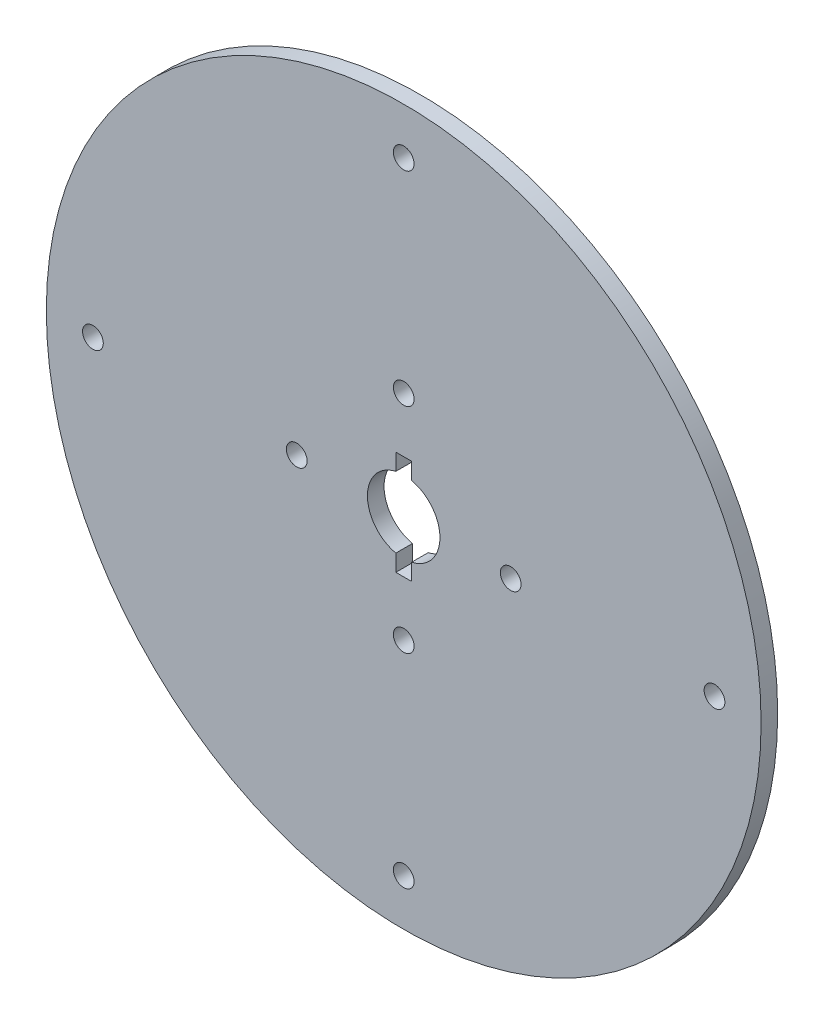
ISO-10303-21;
HEADER;
FILE_DESCRIPTION(('STEP AP214'),'2;1');
FILE_NAME('part.step','',(''),(''),'','','');
FILE_SCHEMA(('AUTOMOTIVE_DESIGN { 1 0 10303 214 1 1 1 1 }'));
ENDSEC;
DATA;
#1=APPLICATION_CONTEXT('core data for automotive mechanical design processes');
#2=APPLICATION_PROTOCOL_DEFINITION('international standard','automotive_design',2000,#1);
#3=PRODUCT_CONTEXT('',#1,'mechanical');
#4=PRODUCT('Part','Part','',(#3));
#5=PRODUCT_RELATED_PRODUCT_CATEGORY('part','',(#4));
#6=PRODUCT_DEFINITION_FORMATION('','',#4);
#7=PRODUCT_DEFINITION_CONTEXT('part definition',#1,'design');
#8=PRODUCT_DEFINITION('design','',#6,#7);
#9=PRODUCT_DEFINITION_SHAPE('','',#8);
#10=(LENGTH_UNIT() NAMED_UNIT(*) SI_UNIT(.MILLI.,.METRE.));
#11=(NAMED_UNIT(*) PLANE_ANGLE_UNIT() SI_UNIT($,.RADIAN.));
#12=(NAMED_UNIT(*) SI_UNIT($,.STERADIAN.) SOLID_ANGLE_UNIT());
#13=UNCERTAINTY_MEASURE_WITH_UNIT(LENGTH_MEASURE(1.E-05),#10,'distance_accuracy_value','');
#14=(GEOMETRIC_REPRESENTATION_CONTEXT(3) GLOBAL_UNCERTAINTY_ASSIGNED_CONTEXT((#13)) GLOBAL_UNIT_ASSIGNED_CONTEXT((#10,
#11,#12)) REPRESENTATION_CONTEXT('',''));
#15=CARTESIAN_POINT('',(0.,0.,0.));
#16=DIRECTION('',(0.,0.,1.));
#17=DIRECTION('',(1.,0.,0.));
#18=AXIS2_PLACEMENT_3D('',#15,#16,#17);
#19=CARTESIAN_POINT('',(0.,0.,3.2));
#20=DIRECTION('',(0.,0.,1.));
#21=DIRECTION('',(1.,0.,0.));
#22=AXIS2_PLACEMENT_3D('',#19,#20,#21);
#23=PLANE('',#22);
#24=CARTESIAN_POINT('',(2.23271950224158E-11,-60.,3.2));
#25=DIRECTION('',(0.,0.,1.));
#26=DIRECTION('',(1.,0.,0.));
#27=AXIS2_PLACEMENT_3D('',#24,#25,#26);
#28=CIRCLE('',#27,2.);
#29=CARTESIAN_POINT('',(2.00000000002233,-60.,3.2));
#30=VERTEX_POINT('',#29);
#31=EDGE_CURVE('E349',#30,#30,#28,.T.);
#32=ORIENTED_EDGE('',*,*,#31,.F.);
#33=EDGE_LOOP('',(#32));
#34=FACE_BOUND('',#33,.T.);
#35=CARTESIAN_POINT('',(-20.6500000000006,-1.03042574473022E-12,3.2));
#36=DIRECTION('',(0.,0.,1.));
#37=DIRECTION('',(1.,0.,0.));
#38=AXIS2_PLACEMENT_3D('',#35,#36,#37);
#39=CIRCLE('',#38,2.);
#40=CARTESIAN_POINT('',(-18.6500000000006,-1.03042574473022E-12,3.2));
#41=VERTEX_POINT('',#40);
#42=EDGE_CURVE('E361',#41,#41,#39,.T.);
#43=ORIENTED_EDGE('',*,*,#42,.F.);
#44=EDGE_LOOP('',(#43));
#45=FACE_BOUND('',#44,.T.);
#46=CARTESIAN_POINT('',(20.6500000000006,-1.02348685082632E-13,3.2));
#47=DIRECTION('',(0.,0.,1.));
#48=DIRECTION('',(1.,0.,0.));
#49=AXIS2_PLACEMENT_3D('',#46,#47,#48);
#50=CIRCLE('',#49,2.);
#51=CARTESIAN_POINT('',(22.6500000000006,-1.02348685082632E-13,3.2));
#52=VERTEX_POINT('',#51);
#53=EDGE_CURVE('E373',#52,#52,#50,.T.);
#54=ORIENTED_EDGE('',*,*,#53,.F.);
#55=EDGE_LOOP('',(#54));
#56=FACE_BOUND('',#55,.T.);
#57=CARTESIAN_POINT('',(0.,20.65,3.2));
#58=DIRECTION('',(0.,0.,1.));
#59=DIRECTION('',(1.,0.,0.));
#60=AXIS2_PLACEMENT_3D('',#57,#58,#59);
#61=CIRCLE('',#60,2.);
#62=CARTESIAN_POINT('',(2.00000000000001,20.65,3.2));
#63=VERTEX_POINT('',#62);
#64=EDGE_CURVE('E134',#63,#63,#61,.T.);
#65=ORIENTED_EDGE('',*,*,#64,.F.);
#66=EDGE_LOOP('',(#65));
#67=FACE_BOUND('',#66,.T.);
#68=CARTESIAN_POINT('',(0.,0.,3.2));
#69=DIRECTION('',(0.,0.,1.));
#70=DIRECTION('',(1.,0.,0.));
#71=AXIS2_PLACEMENT_3D('',#68,#69,#70);
#72=CIRCLE('',#71,69.);
#73=CARTESIAN_POINT('',(69.,0.,3.2));
#74=VERTEX_POINT('',#73);
#75=EDGE_CURVE('E11',#74,#74,#72,.T.);
#76=ORIENTED_EDGE('',*,*,#75,.T.);
#77=EDGE_LOOP('',(#76));
#78=FACE_BOUND('',#77,.T.);
#79=CARTESIAN_POINT('',(1.00028492433513E-12,0.,3.2));
#80=DIRECTION('',(0.,0.,1.));
#81=DIRECTION('',(1.,0.,0.));
#82=AXIS2_PLACEMENT_3D('',#79,#80,#81);
#83=CIRCLE('',#82,7.00000000000022);
#84=CARTESIAN_POINT('',(-1.52499999999999,6.83186467957321,3.2));
#85=VERTEX_POINT('',#84);
#86=CARTESIAN_POINT('',(-1.52499999999999,-6.83186467957321,3.2));
#87=VERTEX_POINT('',#86);
#88=EDGE_CURVE('E105',#85,#87,#83,.T.);
#89=ORIENTED_EDGE('',*,*,#88,.F.);
#90=DIRECTION('',(0.,-1.,0.));
#91=VECTOR('',#90,1.);
#92=CARTESIAN_POINT('',(-1.52499999999999,10.05,3.2));
#93=LINE('',#92,#91);
#94=CARTESIAN_POINT('',(-1.52499999999999,10.05,3.2));
#95=VERTEX_POINT('',#94);
#96=EDGE_CURVE('E97',#95,#85,#93,.T.);
#97=ORIENTED_EDGE('',*,*,#96,.F.);
#98=DIRECTION('',(-1.,0.,0.));
#99=VECTOR('',#98,1.);
#100=CARTESIAN_POINT('',(-1.52499999999999,10.05,3.2));
#101=LINE('',#100,#99);
#102=CARTESIAN_POINT('',(1.52500000000001,10.05,3.2));
#103=VERTEX_POINT('',#102);
#104=EDGE_CURVE('E131',#103,#95,#101,.T.);
#105=ORIENTED_EDGE('',*,*,#104,.F.);
#106=DIRECTION('',(0.,1.,0.));
#107=VECTOR('',#106,1.);
#108=CARTESIAN_POINT('',(1.52500000000001,10.05,3.2));
#109=LINE('',#108,#107);
#110=CARTESIAN_POINT('',(1.52500000000001,6.83186467957321,3.2));
#111=VERTEX_POINT('',#110);
#112=EDGE_CURVE('E129',#111,#103,#109,.T.);
#113=ORIENTED_EDGE('',*,*,#112,.F.);
#114=CARTESIAN_POINT('',(9.79034561754411E-13,0.,3.2));
#115=DIRECTION('',(0.,0.,1.));
#116=DIRECTION('',(-1.,0.,0.));
#117=AXIS2_PLACEMENT_3D('',#114,#115,#116);
#118=CIRCLE('',#117,6.99999999999979);
#119=CARTESIAN_POINT('',(1.52500000000001,-6.83186467957321,3.2));
#120=VERTEX_POINT('',#119);
#121=EDGE_CURVE('E127',#120,#111,#118,.T.);
#122=ORIENTED_EDGE('',*,*,#121,.F.);
#123=DIRECTION('',(0.,1.,0.));
#124=VECTOR('',#123,1.);
#125=CARTESIAN_POINT('',(1.52500000000001,-10.05,3.2));
#126=LINE('',#125,#124);
#127=CARTESIAN_POINT('',(1.52500000000001,-10.05,3.2));
#128=VERTEX_POINT('',#127);
#129=EDGE_CURVE('E125',#128,#120,#126,.T.);
#130=ORIENTED_EDGE('',*,*,#129,.F.);
#131=DIRECTION('',(1.,0.,0.));
#132=VECTOR('',#131,1.);
#133=CARTESIAN_POINT('',(-1.52499999999999,-10.05,3.2));
#134=LINE('',#133,#132);
#135=CARTESIAN_POINT('',(-1.52499999999999,-10.05,3.2));
#136=VERTEX_POINT('',#135);
#137=EDGE_CURVE('E120',#136,#128,#134,.T.);
#138=ORIENTED_EDGE('',*,*,#137,.F.);
#139=DIRECTION('',(0.,-1.,0.));
#140=VECTOR('',#139,1.);
#141=CARTESIAN_POINT('',(-1.52499999999999,-10.05,3.2));
#142=LINE('',#141,#140);
#143=EDGE_CURVE('E118',#87,#136,#142,.T.);
#144=ORIENTED_EDGE('',*,*,#143,.F.);
#145=EDGE_LOOP('',(#89,#97,#105,#113,#122,#130,#138,#144));
#146=FACE_BOUND('',#145,.T.);
#147=CARTESIAN_POINT('',(0.,60.,3.2));
#148=DIRECTION('',(0.,0.,1.));
#149=DIRECTION('',(1.,0.,0.));
#150=AXIS2_PLACEMENT_3D('',#147,#148,#149);
#151=CIRCLE('',#150,2.);
#152=CARTESIAN_POINT('',(1.99999999999999,60.,3.2));
#153=VERTEX_POINT('',#152);
#154=EDGE_CURVE('E379',#153,#153,#151,.T.);
#155=ORIENTED_EDGE('',*,*,#154,.F.);
#156=EDGE_LOOP('',(#155));
#157=FACE_BOUND('',#156,.T.);
#158=CARTESIAN_POINT('',(4.65137769486632E-13,-20.6500000000009,3.2));
#159=DIRECTION('',(0.,0.,1.));
#160=DIRECTION('',(1.,0.,0.));
#161=AXIS2_PLACEMENT_3D('',#158,#159,#160);
#162=CIRCLE('',#161,2.);
#163=CARTESIAN_POINT('',(2.00000000000047,-20.6500000000009,3.2));
#164=VERTEX_POINT('',#163);
#165=EDGE_CURVE('E367',#164,#164,#162,.T.);
#166=ORIENTED_EDGE('',*,*,#165,.F.);
#167=EDGE_LOOP('',(#166));
#168=FACE_BOUND('',#167,.T.);
#169=CARTESIAN_POINT('',(60.0000000000111,1.11693024223492E-11,3.2));
#170=DIRECTION('',(0.,0.,1.));
#171=DIRECTION('',(1.,0.,0.));
#172=AXIS2_PLACEMENT_3D('',#169,#170,#171);
#173=CIRCLE('',#172,2.);
#174=CARTESIAN_POINT('',(62.0000000000111,1.11693024223492E-11,3.2));
#175=VERTEX_POINT('',#174);
#176=EDGE_CURVE('E355',#175,#175,#173,.T.);
#177=ORIENTED_EDGE('',*,*,#176,.F.);
#178=EDGE_LOOP('',(#177));
#179=FACE_BOUND('',#178,.T.);
#180=CARTESIAN_POINT('',(-59.9999999999888,-1.11766503031441E-11,3.2));
#181=DIRECTION('',(0.,0.,1.));
#182=DIRECTION('',(1.,0.,0.));
#183=AXIS2_PLACEMENT_3D('',#180,#181,#182);
#184=CIRCLE('',#183,2.);
#185=CARTESIAN_POINT('',(-57.9999999999888,-1.11766503031441E-11,3.2));
#186=VERTEX_POINT('',#185);
#187=EDGE_CURVE('E340',#186,#186,#184,.T.);
#188=ORIENTED_EDGE('',*,*,#187,.F.);
#189=EDGE_LOOP('',(#188));
#190=FACE_BOUND('',#189,.T.);
#191=ADVANCED_FACE('F32',(#34,#45,#56,#67,#78,#146,#157,#168,#179,#190),#23,.T.);
#192=CARTESIAN_POINT('',(0.,0.,0.));
#193=DIRECTION('',(0.,0.,1.));
#194=DIRECTION('',(1.,0.,0.));
#195=AXIS2_PLACEMENT_3D('',#192,#193,#194);
#196=PLANE('',#195);
#197=CARTESIAN_POINT('',(0.,0.,0.));
#198=DIRECTION('',(0.,0.,1.));
#199=DIRECTION('',(1.,0.,0.));
#200=AXIS2_PLACEMENT_3D('',#197,#198,#199);
#201=CIRCLE('',#200,69.);
#202=CARTESIAN_POINT('',(69.,0.,0.));
#203=VERTEX_POINT('',#202);
#204=EDGE_CURVE('E36',#203,#203,#201,.T.);
#205=ORIENTED_EDGE('',*,*,#204,.F.);
#206=EDGE_LOOP('',(#205));
#207=FACE_BOUND('',#206,.T.);
#208=DIRECTION('',(0.,-1.,0.));
#209=VECTOR('',#208,1.);
#210=CARTESIAN_POINT('',(-1.52499999999999,10.05,0.));
#211=LINE('',#210,#209);
#212=CARTESIAN_POINT('',(-1.52499999999999,10.05,0.));
#213=VERTEX_POINT('',#212);
#214=CARTESIAN_POINT('',(-1.52499999999999,6.83186467957321,0.));
#215=VERTEX_POINT('',#214);
#216=EDGE_CURVE('E55',#213,#215,#211,.T.);
#217=ORIENTED_EDGE('',*,*,#216,.T.);
#218=CARTESIAN_POINT('',(1.00028492433513E-12,0.,0.));
#219=DIRECTION('',(0.,0.,1.));
#220=DIRECTION('',(1.,0.,0.));
#221=AXIS2_PLACEMENT_3D('',#218,#219,#220);
#222=CIRCLE('',#221,7.00000000000022);
#223=CARTESIAN_POINT('',(-1.52499999999999,-6.83186467957321,0.));
#224=VERTEX_POINT('',#223);
#225=EDGE_CURVE('E112',#215,#224,#222,.T.);
#226=ORIENTED_EDGE('',*,*,#225,.T.);
#227=DIRECTION('',(0.,-1.,0.));
#228=VECTOR('',#227,1.);
#229=CARTESIAN_POINT('',(-1.52499999999999,-10.05,0.));
#230=LINE('',#229,#228);
#231=CARTESIAN_POINT('',(-1.52499999999999,-10.05,0.));
#232=VERTEX_POINT('',#231);
#233=EDGE_CURVE('E136',#224,#232,#230,.T.);
#234=ORIENTED_EDGE('',*,*,#233,.T.);
#235=DIRECTION('',(1.,0.,0.));
#236=VECTOR('',#235,1.);
#237=CARTESIAN_POINT('',(-1.52499999999999,-10.05,0.));
#238=LINE('',#237,#236);
#239=CARTESIAN_POINT('',(1.52500000000001,-10.05,0.));
#240=VERTEX_POINT('',#239);
#241=EDGE_CURVE('E139',#232,#240,#238,.T.);
#242=ORIENTED_EDGE('',*,*,#241,.T.);
#243=DIRECTION('',(0.,1.,0.));
#244=VECTOR('',#243,1.);
#245=CARTESIAN_POINT('',(1.52500000000001,-10.05,0.));
#246=LINE('',#245,#244);
#247=CARTESIAN_POINT('',(1.52500000000001,-6.83186467957321,0.));
#248=VERTEX_POINT('',#247);
#249=EDGE_CURVE('E142',#240,#248,#246,.T.);
#250=ORIENTED_EDGE('',*,*,#249,.T.);
#251=CARTESIAN_POINT('',(9.79034561754411E-13,0.,0.));
#252=DIRECTION('',(0.,0.,1.));
#253=DIRECTION('',(-1.,0.,0.));
#254=AXIS2_PLACEMENT_3D('',#251,#252,#253);
#255=CIRCLE('',#254,6.99999999999979);
#256=CARTESIAN_POINT('',(1.52500000000001,6.83186467957321,0.));
#257=VERTEX_POINT('',#256);
#258=EDGE_CURVE('E145',#248,#257,#255,.T.);
#259=ORIENTED_EDGE('',*,*,#258,.T.);
#260=DIRECTION('',(0.,1.,0.));
#261=VECTOR('',#260,1.);
#262=CARTESIAN_POINT('',(1.52500000000001,10.05,0.));
#263=LINE('',#262,#261);
#264=CARTESIAN_POINT('',(1.52500000000001,10.05,0.));
#265=VERTEX_POINT('',#264);
#266=EDGE_CURVE('E148',#257,#265,#263,.T.);
#267=ORIENTED_EDGE('',*,*,#266,.T.);
#268=DIRECTION('',(-1.,0.,0.));
#269=VECTOR('',#268,1.);
#270=CARTESIAN_POINT('',(-1.52499999999999,10.05,0.));
#271=LINE('',#270,#269);
#272=EDGE_CURVE('E106',#265,#213,#271,.T.);
#273=ORIENTED_EDGE('',*,*,#272,.T.);
#274=EDGE_LOOP('',(#217,#226,#234,#242,#250,#259,#267,#273));
#275=FACE_BOUND('',#274,.T.);
#276=CARTESIAN_POINT('',(0.,20.65,0.));
#277=DIRECTION('',(0.,0.,1.));
#278=DIRECTION('',(1.,0.,0.));
#279=AXIS2_PLACEMENT_3D('',#276,#277,#278);
#280=CIRCLE('',#279,2.);
#281=CARTESIAN_POINT('',(2.00000000000001,20.65,0.));
#282=VERTEX_POINT('',#281);
#283=EDGE_CURVE('E382',#282,#282,#280,.T.);
#284=ORIENTED_EDGE('',*,*,#283,.T.);
#285=EDGE_LOOP('',(#284));
#286=FACE_BOUND('',#285,.T.);
#287=CARTESIAN_POINT('',(0.,60.,0.));
#288=DIRECTION('',(0.,0.,1.));
#289=DIRECTION('',(1.,0.,0.));
#290=AXIS2_PLACEMENT_3D('',#287,#288,#289);
#291=CIRCLE('',#290,2.);
#292=CARTESIAN_POINT('',(1.99999999999999,60.,0.));
#293=VERTEX_POINT('',#292);
#294=EDGE_CURVE('E376',#293,#293,#291,.T.);
#295=ORIENTED_EDGE('',*,*,#294,.T.);
#296=EDGE_LOOP('',(#295));
#297=FACE_BOUND('',#296,.T.);
#298=CARTESIAN_POINT('',(20.6500000000006,-1.02348685082632E-13,0.));
#299=DIRECTION('',(0.,0.,1.));
#300=DIRECTION('',(1.,0.,0.));
#301=AXIS2_PLACEMENT_3D('',#298,#299,#300);
#302=CIRCLE('',#301,2.);
#303=CARTESIAN_POINT('',(22.6500000000006,-1.02348685082632E-13,0.));
#304=VERTEX_POINT('',#303);
#305=EDGE_CURVE('E370',#304,#304,#302,.T.);
#306=ORIENTED_EDGE('',*,*,#305,.T.);
#307=EDGE_LOOP('',(#306));
#308=FACE_BOUND('',#307,.T.);
#309=CARTESIAN_POINT('',(4.65137769486632E-13,-20.6500000000009,0.));
#310=DIRECTION('',(0.,0.,1.));
#311=DIRECTION('',(1.,0.,0.));
#312=AXIS2_PLACEMENT_3D('',#309,#310,#311);
#313=CIRCLE('',#312,2.);
#314=CARTESIAN_POINT('',(2.00000000000047,-20.6500000000009,0.));
#315=VERTEX_POINT('',#314);
#316=EDGE_CURVE('E364',#315,#315,#313,.T.);
#317=ORIENTED_EDGE('',*,*,#316,.T.);
#318=EDGE_LOOP('',(#317));
#319=FACE_BOUND('',#318,.T.);
#320=CARTESIAN_POINT('',(-20.6500000000006,-1.03042574473022E-12,0.));
#321=DIRECTION('',(0.,0.,1.));
#322=DIRECTION('',(1.,0.,0.));
#323=AXIS2_PLACEMENT_3D('',#320,#321,#322);
#324=CIRCLE('',#323,2.);
#325=CARTESIAN_POINT('',(-18.6500000000006,-1.03042574473022E-12,0.));
#326=VERTEX_POINT('',#325);
#327=EDGE_CURVE('E358',#326,#326,#324,.T.);
#328=ORIENTED_EDGE('',*,*,#327,.T.);
#329=EDGE_LOOP('',(#328));
#330=FACE_BOUND('',#329,.T.);
#331=CARTESIAN_POINT('',(60.0000000000111,1.11693024223492E-11,0.));
#332=DIRECTION('',(0.,0.,1.));
#333=DIRECTION('',(1.,0.,0.));
#334=AXIS2_PLACEMENT_3D('',#331,#332,#333);
#335=CIRCLE('',#334,2.);
#336=CARTESIAN_POINT('',(62.0000000000111,1.11693024223492E-11,0.));
#337=VERTEX_POINT('',#336);
#338=EDGE_CURVE('E352',#337,#337,#335,.T.);
#339=ORIENTED_EDGE('',*,*,#338,.T.);
#340=EDGE_LOOP('',(#339));
#341=FACE_BOUND('',#340,.T.);
#342=CARTESIAN_POINT('',(2.23271950224158E-11,-60.,0.));
#343=DIRECTION('',(0.,0.,1.));
#344=DIRECTION('',(1.,0.,0.));
#345=AXIS2_PLACEMENT_3D('',#342,#343,#344);
#346=CIRCLE('',#345,2.);
#347=CARTESIAN_POINT('',(2.00000000002233,-60.,0.));
#348=VERTEX_POINT('',#347);
#349=EDGE_CURVE('E346',#348,#348,#346,.T.);
#350=ORIENTED_EDGE('',*,*,#349,.T.);
#351=EDGE_LOOP('',(#350));
#352=FACE_BOUND('',#351,.T.);
#353=CARTESIAN_POINT('',(-59.9999999999888,-1.11766503031441E-11,0.));
#354=DIRECTION('',(0.,0.,1.));
#355=DIRECTION('',(1.,0.,0.));
#356=AXIS2_PLACEMENT_3D('',#353,#354,#355);
#357=CIRCLE('',#356,2.);
#358=CARTESIAN_POINT('',(-57.9999999999888,-1.11766503031441E-11,0.));
#359=VERTEX_POINT('',#358);
#360=EDGE_CURVE('E343',#359,#359,#357,.T.);
#361=ORIENTED_EDGE('',*,*,#360,.T.);
#362=EDGE_LOOP('',(#361));
#363=FACE_BOUND('',#362,.T.);
#364=ADVANCED_FACE('F169',(#207,#275,#286,#297,#308,#319,#330,#341,#352,#363),#196,.F.);
#365=CARTESIAN_POINT('',(0.,0.,3.2));
#366=DIRECTION('',(0.,0.,-1.));
#367=DIRECTION('',(-1.,0.,0.));
#368=AXIS2_PLACEMENT_3D('',#365,#366,#367);
#369=CYLINDRICAL_SURFACE('',#368,69.);
#370=ORIENTED_EDGE('',*,*,#75,.F.);
#371=EDGE_LOOP('',(#370));
#372=FACE_BOUND('',#371,.T.);
#373=ORIENTED_EDGE('',*,*,#204,.T.);
#374=EDGE_LOOP('',(#373));
#375=FACE_BOUND('',#374,.T.);
#376=ADVANCED_FACE('F34',(#372,#375),#369,.T.);
#377=CARTESIAN_POINT('',(-1.52499999999999,10.05,3.2));
#378=DIRECTION('',(1.,0.,0.));
#379=DIRECTION('',(0.,1.,0.));
#380=AXIS2_PLACEMENT_3D('',#377,#378,#379);
#381=PLANE('',#380);
#382=ORIENTED_EDGE('',*,*,#216,.F.);
#383=DIRECTION('',(0.,0.,-1.));
#384=VECTOR('',#383,1.);
#385=CARTESIAN_POINT('',(-1.52499999999999,10.05,3.2));
#386=LINE('',#385,#384);
#387=EDGE_CURVE('E101',#95,#213,#386,.T.);
#388=ORIENTED_EDGE('',*,*,#387,.F.);
#389=ORIENTED_EDGE('',*,*,#96,.T.);
#390=DIRECTION('',(0.,0.,-1.));
#391=VECTOR('',#390,1.);
#392=CARTESIAN_POINT('',(-1.52499999999999,6.83186467957321,3.2));
#393=LINE('',#392,#391);
#394=EDGE_CURVE('E100',#85,#215,#393,.T.);
#395=ORIENTED_EDGE('',*,*,#394,.T.);
#396=EDGE_LOOP('',(#382,#388,#389,#395));
#397=FACE_BOUND('',#396,.T.);
#398=ADVANCED_FACE('F99',(#397),#381,.T.);
#399=CARTESIAN_POINT('',(1.00028492433513E-12,0.,3.2));
#400=DIRECTION('',(0.,0.,-1.));
#401=DIRECTION('',(-1.,0.,0.));
#402=AXIS2_PLACEMENT_3D('',#399,#400,#401);
#403=CYLINDRICAL_SURFACE('',#402,7.00000000000022);
#404=ORIENTED_EDGE('',*,*,#225,.F.);
#405=ORIENTED_EDGE('',*,*,#394,.F.);
#406=ORIENTED_EDGE('',*,*,#88,.T.);
#407=DIRECTION('',(0.,0.,-1.));
#408=VECTOR('',#407,1.);
#409=CARTESIAN_POINT('',(-1.52499999999999,-6.83186467957321,3.2));
#410=LINE('',#409,#408);
#411=EDGE_CURVE('E113',#87,#224,#410,.T.);
#412=ORIENTED_EDGE('',*,*,#411,.T.);
#413=EDGE_LOOP('',(#404,#405,#406,#412));
#414=FACE_BOUND('',#413,.T.);
#415=ADVANCED_FACE('F109',(#414),#403,.F.);
#416=CARTESIAN_POINT('',(-1.52499999999999,-10.05,3.2));
#417=DIRECTION('',(1.,0.,0.));
#418=DIRECTION('',(0.,1.,0.));
#419=AXIS2_PLACEMENT_3D('',#416,#417,#418);
#420=PLANE('',#419);
#421=ORIENTED_EDGE('',*,*,#233,.F.);
#422=ORIENTED_EDGE('',*,*,#411,.F.);
#423=ORIENTED_EDGE('',*,*,#143,.T.);
#424=DIRECTION('',(0.,0.,-1.));
#425=VECTOR('',#424,1.);
#426=CARTESIAN_POINT('',(-1.52499999999999,-10.05,3.2));
#427=LINE('',#426,#425);
#428=EDGE_CURVE('E161',#136,#232,#427,.T.);
#429=ORIENTED_EDGE('',*,*,#428,.T.);
#430=EDGE_LOOP('',(#421,#422,#423,#429));
#431=FACE_BOUND('',#430,.T.);
#432=ADVANCED_FACE('F165',(#431),#420,.T.);
#433=CARTESIAN_POINT('',(-1.52499999999999,-10.05,3.2));
#434=DIRECTION('',(0.,1.,0.));
#435=DIRECTION('',(0.,0.,1.));
#436=AXIS2_PLACEMENT_3D('',#433,#434,#435);
#437=PLANE('',#436);
#438=ORIENTED_EDGE('',*,*,#241,.F.);
#439=ORIENTED_EDGE('',*,*,#428,.F.);
#440=ORIENTED_EDGE('',*,*,#137,.T.);
#441=DIRECTION('',(0.,0.,-1.));
#442=VECTOR('',#441,1.);
#443=CARTESIAN_POINT('',(1.52500000000001,-10.05,3.2));
#444=LINE('',#443,#442);
#445=EDGE_CURVE('E159',#128,#240,#444,.T.);
#446=ORIENTED_EDGE('',*,*,#445,.T.);
#447=EDGE_LOOP('',(#438,#439,#440,#446));
#448=FACE_BOUND('',#447,.T.);
#449=ADVANCED_FACE('F188',(#448),#437,.T.);
#450=CARTESIAN_POINT('',(1.52500000000001,-10.05,3.2));
#451=DIRECTION('',(-1.,0.,0.));
#452=DIRECTION('',(0.,-1.,0.));
#453=AXIS2_PLACEMENT_3D('',#450,#451,#452);
#454=PLANE('',#453);
#455=ORIENTED_EDGE('',*,*,#249,.F.);
#456=ORIENTED_EDGE('',*,*,#445,.F.);
#457=ORIENTED_EDGE('',*,*,#129,.T.);
#458=DIRECTION('',(0.,0.,-1.));
#459=VECTOR('',#458,1.);
#460=CARTESIAN_POINT('',(1.52500000000001,-6.83186467957321,3.2));
#461=LINE('',#460,#459);
#462=EDGE_CURVE('E157',#120,#248,#461,.T.);
#463=ORIENTED_EDGE('',*,*,#462,.T.);
#464=EDGE_LOOP('',(#455,#456,#457,#463));
#465=FACE_BOUND('',#464,.T.);
#466=ADVANCED_FACE('F185',(#465),#454,.T.);
#467=CARTESIAN_POINT('',(9.79034561754411E-13,0.,3.2));
#468=DIRECTION('',(0.,0.,-1.));
#469=DIRECTION('',(-1.,0.,0.));
#470=AXIS2_PLACEMENT_3D('',#467,#468,#469);
#471=CYLINDRICAL_SURFACE('',#470,6.99999999999979);
#472=ORIENTED_EDGE('',*,*,#258,.F.);
#473=ORIENTED_EDGE('',*,*,#462,.F.);
#474=ORIENTED_EDGE('',*,*,#121,.T.);
#475=DIRECTION('',(0.,0.,-1.));
#476=VECTOR('',#475,1.);
#477=CARTESIAN_POINT('',(1.52500000000001,6.83186467957321,3.2));
#478=LINE('',#477,#476);
#479=EDGE_CURVE('E155',#111,#257,#478,.T.);
#480=ORIENTED_EDGE('',*,*,#479,.T.);
#481=EDGE_LOOP('',(#472,#473,#474,#480));
#482=FACE_BOUND('',#481,.T.);
#483=ADVANCED_FACE('F181',(#482),#471,.F.);
#484=CARTESIAN_POINT('',(1.52500000000001,10.05,3.2));
#485=DIRECTION('',(-1.,0.,0.));
#486=DIRECTION('',(0.,-1.,0.));
#487=AXIS2_PLACEMENT_3D('',#484,#485,#486);
#488=PLANE('',#487);
#489=ORIENTED_EDGE('',*,*,#266,.F.);
#490=ORIENTED_EDGE('',*,*,#479,.F.);
#491=ORIENTED_EDGE('',*,*,#112,.T.);
#492=DIRECTION('',(0.,0.,-1.));
#493=VECTOR('',#492,1.);
#494=CARTESIAN_POINT('',(1.52500000000001,10.05,3.2));
#495=LINE('',#494,#493);
#496=EDGE_CURVE('E47',#103,#265,#495,.T.);
#497=ORIENTED_EDGE('',*,*,#496,.T.);
#498=EDGE_LOOP('',(#489,#490,#491,#497));
#499=FACE_BOUND('',#498,.T.);
#500=ADVANCED_FACE('F178',(#499),#488,.T.);
#501=CARTESIAN_POINT('',(-1.52499999999999,10.05,3.2));
#502=DIRECTION('',(0.,-1.,0.));
#503=DIRECTION('',(0.,0.,-1.));
#504=AXIS2_PLACEMENT_3D('',#501,#502,#503);
#505=PLANE('',#504);
#506=ORIENTED_EDGE('',*,*,#272,.F.);
#507=ORIENTED_EDGE('',*,*,#496,.F.);
#508=ORIENTED_EDGE('',*,*,#104,.T.);
#509=ORIENTED_EDGE('',*,*,#387,.T.);
#510=EDGE_LOOP('',(#506,#507,#508,#509));
#511=FACE_BOUND('',#510,.T.);
#512=ADVANCED_FACE('F172',(#511),#505,.T.);
#513=CARTESIAN_POINT('',(0.,20.65,3.2));
#514=DIRECTION('',(0.,0.,-1.));
#515=DIRECTION('',(-1.,0.,0.));
#516=AXIS2_PLACEMENT_3D('',#513,#514,#515);
#517=CYLINDRICAL_SURFACE('',#516,2.);
#518=ORIENTED_EDGE('',*,*,#64,.T.);
#519=EDGE_LOOP('',(#518));
#520=FACE_BOUND('',#519,.T.);
#521=ORIENTED_EDGE('',*,*,#283,.F.);
#522=EDGE_LOOP('',(#521));
#523=FACE_BOUND('',#522,.T.);
#524=ADVANCED_FACE('F254',(#520,#523),#517,.F.);
#525=CARTESIAN_POINT('',(0.,60.,3.2));
#526=DIRECTION('',(0.,0.,-1.));
#527=DIRECTION('',(-1.,0.,0.));
#528=AXIS2_PLACEMENT_3D('',#525,#526,#527);
#529=CYLINDRICAL_SURFACE('',#528,2.);
#530=ORIENTED_EDGE('',*,*,#154,.T.);
#531=EDGE_LOOP('',(#530));
#532=FACE_BOUND('',#531,.T.);
#533=ORIENTED_EDGE('',*,*,#294,.F.);
#534=EDGE_LOOP('',(#533));
#535=FACE_BOUND('',#534,.T.);
#536=ADVANCED_FACE('F263',(#532,#535),#529,.F.);
#537=CARTESIAN_POINT('',(20.6500000000006,-1.02348685082632E-13,3.2));
#538=DIRECTION('',(0.,0.,-1.));
#539=DIRECTION('',(-1.,0.,0.));
#540=AXIS2_PLACEMENT_3D('',#537,#538,#539);
#541=CYLINDRICAL_SURFACE('',#540,2.);
#542=ORIENTED_EDGE('',*,*,#53,.T.);
#543=EDGE_LOOP('',(#542));
#544=FACE_BOUND('',#543,.T.);
#545=ORIENTED_EDGE('',*,*,#305,.F.);
#546=EDGE_LOOP('',(#545));
#547=FACE_BOUND('',#546,.T.);
#548=ADVANCED_FACE('F273',(#544,#547),#541,.F.);
#549=CARTESIAN_POINT('',(4.65137769486632E-13,-20.6500000000009,3.2));
#550=DIRECTION('',(0.,0.,-1.));
#551=DIRECTION('',(-1.,0.,0.));
#552=AXIS2_PLACEMENT_3D('',#549,#550,#551);
#553=CYLINDRICAL_SURFACE('',#552,2.);
#554=ORIENTED_EDGE('',*,*,#165,.T.);
#555=EDGE_LOOP('',(#554));
#556=FACE_BOUND('',#555,.T.);
#557=ORIENTED_EDGE('',*,*,#316,.F.);
#558=EDGE_LOOP('',(#557));
#559=FACE_BOUND('',#558,.T.);
#560=ADVANCED_FACE('F283',(#556,#559),#553,.F.);
#561=CARTESIAN_POINT('',(-20.6500000000006,-1.03042574473022E-12,3.2));
#562=DIRECTION('',(0.,0.,-1.));
#563=DIRECTION('',(-1.,0.,0.));
#564=AXIS2_PLACEMENT_3D('',#561,#562,#563);
#565=CYLINDRICAL_SURFACE('',#564,2.);
#566=ORIENTED_EDGE('',*,*,#42,.T.);
#567=EDGE_LOOP('',(#566));
#568=FACE_BOUND('',#567,.T.);
#569=ORIENTED_EDGE('',*,*,#327,.F.);
#570=EDGE_LOOP('',(#569));
#571=FACE_BOUND('',#570,.T.);
#572=ADVANCED_FACE('F293',(#568,#571),#565,.F.);
#573=CARTESIAN_POINT('',(60.0000000000111,1.11693024223492E-11,3.2));
#574=DIRECTION('',(0.,0.,-1.));
#575=DIRECTION('',(-1.,0.,0.));
#576=AXIS2_PLACEMENT_3D('',#573,#574,#575);
#577=CYLINDRICAL_SURFACE('',#576,2.);
#578=ORIENTED_EDGE('',*,*,#176,.T.);
#579=EDGE_LOOP('',(#578));
#580=FACE_BOUND('',#579,.T.);
#581=ORIENTED_EDGE('',*,*,#338,.F.);
#582=EDGE_LOOP('',(#581));
#583=FACE_BOUND('',#582,.T.);
#584=ADVANCED_FACE('F303',(#580,#583),#577,.F.);
#585=CARTESIAN_POINT('',(2.23271950224158E-11,-60.,3.2));
#586=DIRECTION('',(0.,0.,-1.));
#587=DIRECTION('',(-1.,0.,0.));
#588=AXIS2_PLACEMENT_3D('',#585,#586,#587);
#589=CYLINDRICAL_SURFACE('',#588,2.);
#590=ORIENTED_EDGE('',*,*,#31,.T.);
#591=EDGE_LOOP('',(#590));
#592=FACE_BOUND('',#591,.T.);
#593=ORIENTED_EDGE('',*,*,#349,.F.);
#594=EDGE_LOOP('',(#593));
#595=FACE_BOUND('',#594,.T.);
#596=ADVANCED_FACE('F313',(#592,#595),#589,.F.);
#597=CARTESIAN_POINT('',(-59.9999999999888,-1.11766503031441E-11,3.2));
#598=DIRECTION('',(0.,0.,-1.));
#599=DIRECTION('',(-1.,0.,0.));
#600=AXIS2_PLACEMENT_3D('',#597,#598,#599);
#601=CYLINDRICAL_SURFACE('',#600,2.);
#602=ORIENTED_EDGE('',*,*,#187,.T.);
#603=EDGE_LOOP('',(#602));
#604=FACE_BOUND('',#603,.T.);
#605=ORIENTED_EDGE('',*,*,#360,.F.);
#606=EDGE_LOOP('',(#605));
#607=FACE_BOUND('',#606,.T.);
#608=ADVANCED_FACE('F323',(#604,#607),#601,.F.);
#609=CLOSED_SHELL('',(#191,#364,#376,#398,#415,#432,#449,#466,#483,#500,#512,#524,#536,#548,
#560,#572,#584,#596,#608));
#610=MANIFOLD_SOLID_BREP('B2',#609);
#611=ADVANCED_BREP_SHAPE_REPRESENTATION('',(#18,#610),#14);
#612=SHAPE_DEFINITION_REPRESENTATION(#9,#611);
ENDSEC;
END-ISO-10303-21;
